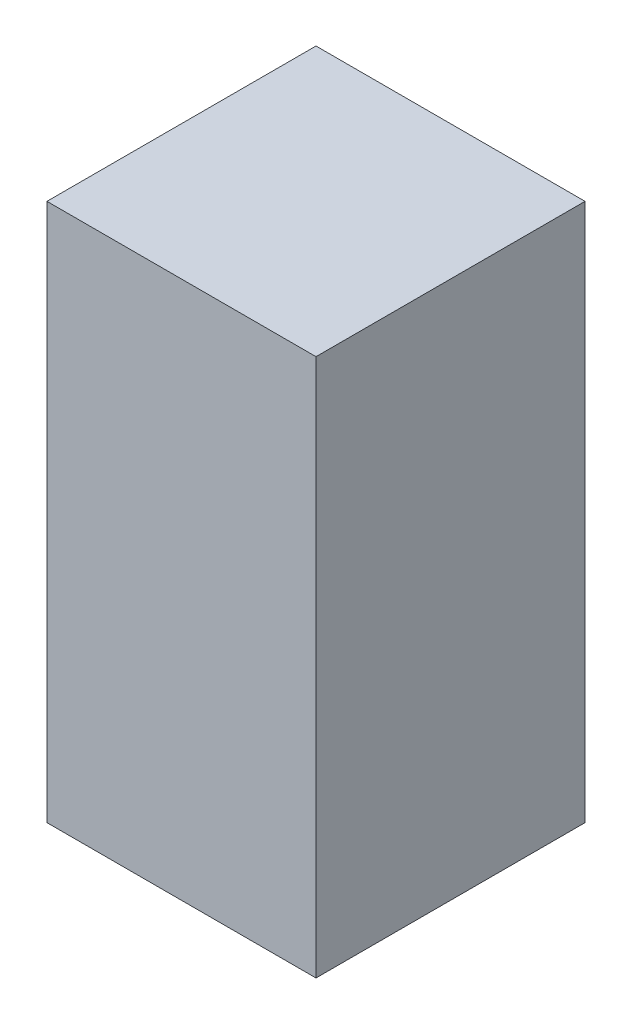
ISO-10303-21;
HEADER;
FILE_DESCRIPTION(('STEP AP214'),'2;1');
FILE_NAME('part.step','',(''),(''),'','','');
FILE_SCHEMA(('AUTOMOTIVE_DESIGN { 1 0 10303 214 1 1 1 1 }'));
ENDSEC;
DATA;
#1=APPLICATION_CONTEXT('core data for automotive mechanical design processes');
#2=APPLICATION_PROTOCOL_DEFINITION('international standard','automotive_design',2000,#1);
#3=PRODUCT_CONTEXT('',#1,'mechanical');
#4=PRODUCT('Part','Part','',(#3));
#5=PRODUCT_RELATED_PRODUCT_CATEGORY('part','',(#4));
#6=PRODUCT_DEFINITION_FORMATION('','',#4);
#7=PRODUCT_DEFINITION_CONTEXT('part definition',#1,'design');
#8=PRODUCT_DEFINITION('design','',#6,#7);
#9=PRODUCT_DEFINITION_SHAPE('','',#8);
#10=(LENGTH_UNIT() NAMED_UNIT(*) SI_UNIT(.MILLI.,.METRE.));
#11=(NAMED_UNIT(*) PLANE_ANGLE_UNIT() SI_UNIT($,.RADIAN.));
#12=(NAMED_UNIT(*) SI_UNIT($,.STERADIAN.) SOLID_ANGLE_UNIT());
#13=UNCERTAINTY_MEASURE_WITH_UNIT(LENGTH_MEASURE(1.E-05),#10,'distance_accuracy_value','');
#14=(GEOMETRIC_REPRESENTATION_CONTEXT(3) GLOBAL_UNCERTAINTY_ASSIGNED_CONTEXT((#13)) GLOBAL_UNIT_ASSIGNED_CONTEXT((#10,
#11,#12)) REPRESENTATION_CONTEXT('',''));
#15=CARTESIAN_POINT('',(0.,0.,0.));
#16=DIRECTION('',(0.,0.,1.));
#17=DIRECTION('',(1.,0.,0.));
#18=AXIS2_PLACEMENT_3D('',#15,#16,#17);
#19=CARTESIAN_POINT('',(12.7,50.8,12.7));
#20=DIRECTION('',(-1.,0.,0.));
#21=DIRECTION('',(0.,0.,1.));
#22=AXIS2_PLACEMENT_3D('',#19,#20,#21);
#23=PLANE('',#22);
#24=DIRECTION('',(0.,0.,-1.));
#25=VECTOR('',#24,1.);
#26=CARTESIAN_POINT('',(12.7,0.,12.7));
#27=LINE('',#26,#25);
#28=CARTESIAN_POINT('',(12.7,0.,12.7));
#29=VERTEX_POINT('',#28);
#30=CARTESIAN_POINT('',(12.7,0.,-12.7));
#31=VERTEX_POINT('',#30);
#32=EDGE_CURVE('E99',#29,#31,#27,.T.);
#33=ORIENTED_EDGE('',*,*,#32,.T.);
#34=DIRECTION('',(0.,-1.,0.));
#35=VECTOR('',#34,1.);
#36=CARTESIAN_POINT('',(12.7,50.8,-12.7));
#37=LINE('',#36,#35);
#38=CARTESIAN_POINT('',(12.7,50.8,-12.7));
#39=VERTEX_POINT('',#38);
#40=EDGE_CURVE('E11',#39,#31,#37,.T.);
#41=ORIENTED_EDGE('',*,*,#40,.F.);
#42=DIRECTION('',(0.,0.,-1.));
#43=VECTOR('',#42,1.);
#44=CARTESIAN_POINT('',(12.7,50.8,12.7));
#45=LINE('',#44,#43);
#46=CARTESIAN_POINT('',(12.7,50.8,12.7));
#47=VERTEX_POINT('',#46);
#48=EDGE_CURVE('E87',#47,#39,#45,.T.);
#49=ORIENTED_EDGE('',*,*,#48,.F.);
#50=DIRECTION('',(0.,-1.,0.));
#51=VECTOR('',#50,1.);
#52=CARTESIAN_POINT('',(12.7,50.8,12.7));
#53=LINE('',#52,#51);
#54=EDGE_CURVE('E95',#47,#29,#53,.T.);
#55=ORIENTED_EDGE('',*,*,#54,.T.);
#56=EDGE_LOOP('',(#33,#41,#49,#55));
#57=FACE_BOUND('',#56,.T.);
#58=ADVANCED_FACE('F36',(#57),#23,.F.);
#59=CARTESIAN_POINT('',(-12.7,50.8,-12.7));
#60=DIRECTION('',(0.,0.,1.));
#61=DIRECTION('',(1.,0.,0.));
#62=AXIS2_PLACEMENT_3D('',#59,#60,#61);
#63=PLANE('',#62);
#64=DIRECTION('',(-1.,0.,0.));
#65=VECTOR('',#64,1.);
#66=CARTESIAN_POINT('',(-12.7,0.,-12.7));
#67=LINE('',#66,#65);
#68=CARTESIAN_POINT('',(-12.7,0.,-12.7));
#69=VERTEX_POINT('',#68);
#70=EDGE_CURVE('E91',#31,#69,#67,.T.);
#71=ORIENTED_EDGE('',*,*,#70,.T.);
#72=DIRECTION('',(0.,-1.,0.));
#73=VECTOR('',#72,1.);
#74=CARTESIAN_POINT('',(-12.7,50.8,-12.7));
#75=LINE('',#74,#73);
#76=CARTESIAN_POINT('',(-12.7,50.8,-12.7));
#77=VERTEX_POINT('',#76);
#78=EDGE_CURVE('E44',#77,#69,#75,.T.);
#79=ORIENTED_EDGE('',*,*,#78,.F.);
#80=DIRECTION('',(-1.,0.,0.));
#81=VECTOR('',#80,1.);
#82=CARTESIAN_POINT('',(-12.7,50.8,-12.7));
#83=LINE('',#82,#81);
#84=EDGE_CURVE('E82',#39,#77,#83,.T.);
#85=ORIENTED_EDGE('',*,*,#84,.F.);
#86=ORIENTED_EDGE('',*,*,#40,.T.);
#87=EDGE_LOOP('',(#71,#79,#85,#86));
#88=FACE_BOUND('',#87,.T.);
#89=ADVANCED_FACE('F90',(#88),#63,.F.);
#90=CARTESIAN_POINT('',(-12.7,50.8,12.7));
#91=DIRECTION('',(1.,0.,0.));
#92=DIRECTION('',(0.,0.,-1.));
#93=AXIS2_PLACEMENT_3D('',#90,#91,#92);
#94=PLANE('',#93);
#95=DIRECTION('',(0.,0.,1.));
#96=VECTOR('',#95,1.);
#97=CARTESIAN_POINT('',(-12.7,0.,12.7));
#98=LINE('',#97,#96);
#99=CARTESIAN_POINT('',(-12.7,0.,12.7));
#100=VERTEX_POINT('',#99);
#101=EDGE_CURVE('E69',#69,#100,#98,.T.);
#102=ORIENTED_EDGE('',*,*,#101,.T.);
#103=DIRECTION('',(0.,-1.,0.));
#104=VECTOR('',#103,1.);
#105=CARTESIAN_POINT('',(-12.7,50.8,12.7));
#106=LINE('',#105,#104);
#107=CARTESIAN_POINT('',(-12.7,50.8,12.7));
#108=VERTEX_POINT('',#107);
#109=EDGE_CURVE('E92',#108,#100,#106,.T.);
#110=ORIENTED_EDGE('',*,*,#109,.F.);
#111=DIRECTION('',(0.,0.,1.));
#112=VECTOR('',#111,1.);
#113=CARTESIAN_POINT('',(-12.7,50.8,12.7));
#114=LINE('',#113,#112);
#115=EDGE_CURVE('E85',#77,#108,#114,.T.);
#116=ORIENTED_EDGE('',*,*,#115,.F.);
#117=ORIENTED_EDGE('',*,*,#78,.T.);
#118=EDGE_LOOP('',(#102,#110,#116,#117));
#119=FACE_BOUND('',#118,.T.);
#120=ADVANCED_FACE('F93',(#119),#94,.F.);
#121=CARTESIAN_POINT('',(-12.7,50.8,12.7));
#122=DIRECTION('',(0.,0.,-1.));
#123=DIRECTION('',(-1.,0.,0.));
#124=AXIS2_PLACEMENT_3D('',#121,#122,#123);
#125=PLANE('',#124);
#126=DIRECTION('',(1.,0.,0.));
#127=VECTOR('',#126,1.);
#128=CARTESIAN_POINT('',(-12.7,0.,12.7));
#129=LINE('',#128,#127);
#130=EDGE_CURVE('E75',#100,#29,#129,.T.);
#131=ORIENTED_EDGE('',*,*,#130,.T.);
#132=ORIENTED_EDGE('',*,*,#54,.F.);
#133=DIRECTION('',(1.,0.,0.));
#134=VECTOR('',#133,1.);
#135=CARTESIAN_POINT('',(-12.7,50.8,12.7));
#136=LINE('',#135,#134);
#137=EDGE_CURVE('E52',#108,#47,#136,.T.);
#138=ORIENTED_EDGE('',*,*,#137,.F.);
#139=ORIENTED_EDGE('',*,*,#109,.T.);
#140=EDGE_LOOP('',(#131,#132,#138,#139));
#141=FACE_BOUND('',#140,.T.);
#142=ADVANCED_FACE('F106',(#141),#125,.F.);
#143=CARTESIAN_POINT('',(0.,50.8,0.));
#144=DIRECTION('',(0.,-1.,0.));
#145=DIRECTION('',(0.,0.,-1.));
#146=AXIS2_PLACEMENT_3D('',#143,#144,#145);
#147=PLANE('',#146);
#148=ORIENTED_EDGE('',*,*,#48,.T.);
#149=ORIENTED_EDGE('',*,*,#84,.T.);
#150=ORIENTED_EDGE('',*,*,#115,.T.);
#151=ORIENTED_EDGE('',*,*,#137,.T.);
#152=EDGE_LOOP('',(#148,#149,#150,#151));
#153=FACE_BOUND('',#152,.T.);
#154=ADVANCED_FACE('F83',(#153),#147,.F.);
#155=CARTESIAN_POINT('',(0.,0.,0.));
#156=DIRECTION('',(0.,-1.,0.));
#157=DIRECTION('',(0.,0.,-1.));
#158=AXIS2_PLACEMENT_3D('',#155,#156,#157);
#159=PLANE('',#158);
#160=ORIENTED_EDGE('',*,*,#32,.F.);
#161=ORIENTED_EDGE('',*,*,#130,.F.);
#162=ORIENTED_EDGE('',*,*,#101,.F.);
#163=ORIENTED_EDGE('',*,*,#70,.F.);
#164=EDGE_LOOP('',(#160,#161,#162,#163));
#165=FACE_BOUND('',#164,.T.);
#166=ADVANCED_FACE('F109',(#165),#159,.T.);
#167=CLOSED_SHELL('',(#58,#89,#120,#142,#154,#166));
#168=MANIFOLD_SOLID_BREP('B2',#167);
#169=ADVANCED_BREP_SHAPE_REPRESENTATION('',(#18,#168),#14);
#170=SHAPE_DEFINITION_REPRESENTATION(#9,#169);
ENDSEC;
END-ISO-10303-21;
